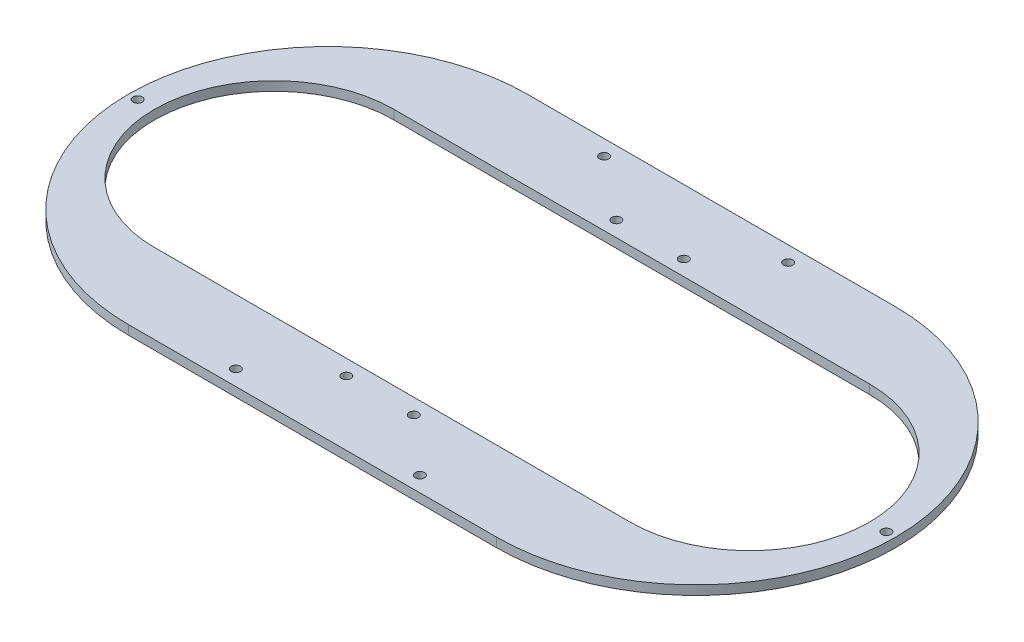
ISO-10303-21;
HEADER;
FILE_DESCRIPTION(('STEP AP214'),'2;1');
FILE_NAME('part.step','',(''),(''),'','','');
FILE_SCHEMA(('AUTOMOTIVE_DESIGN { 1 0 10303 214 1 1 1 1 }'));
ENDSEC;
DATA;
#1=APPLICATION_CONTEXT('core data for automotive mechanical design processes');
#2=APPLICATION_PROTOCOL_DEFINITION('international standard','automotive_design',2000,#1);
#3=PRODUCT_CONTEXT('',#1,'mechanical');
#4=PRODUCT('Part','Part','',(#3));
#5=PRODUCT_RELATED_PRODUCT_CATEGORY('part','',(#4));
#6=PRODUCT_DEFINITION_FORMATION('','',#4);
#7=PRODUCT_DEFINITION_CONTEXT('part definition',#1,'design');
#8=PRODUCT_DEFINITION('design','',#6,#7);
#9=PRODUCT_DEFINITION_SHAPE('','',#8);
#10=(LENGTH_UNIT() NAMED_UNIT(*) SI_UNIT(.MILLI.,.METRE.));
#11=(NAMED_UNIT(*) PLANE_ANGLE_UNIT() SI_UNIT($,.RADIAN.));
#12=(NAMED_UNIT(*) SI_UNIT($,.STERADIAN.) SOLID_ANGLE_UNIT());
#13=UNCERTAINTY_MEASURE_WITH_UNIT(LENGTH_MEASURE(1.E-05),#10,'distance_accuracy_value','');
#14=(GEOMETRIC_REPRESENTATION_CONTEXT(3) GLOBAL_UNCERTAINTY_ASSIGNED_CONTEXT((#13)) GLOBAL_UNIT_ASSIGNED_CONTEXT((#10,
#11,#12)) REPRESENTATION_CONTEXT('',''));
#15=CARTESIAN_POINT('',(0.,0.,0.));
#16=DIRECTION('',(0.,0.,1.));
#17=DIRECTION('',(1.,0.,0.));
#18=AXIS2_PLACEMENT_3D('',#15,#16,#17);
#19=CARTESIAN_POINT('',(0.,3.,-65.));
#20=DIRECTION('',(0.,0.,-1.));
#21=DIRECTION('',(-1.,0.,0.));
#22=AXIS2_PLACEMENT_3D('',#19,#20,#21);
#23=PLANE('',#22);
#24=DIRECTION('',(1.,0.,0.));
#25=VECTOR('',#24,1.);
#26=CARTESIAN_POINT('',(0.,0.,-65.));
#27=LINE('',#26,#25);
#28=CARTESIAN_POINT('',(-60.,0.,-65.));
#29=VERTEX_POINT('',#28);
#30=CARTESIAN_POINT('',(60.,0.,-65.));
#31=VERTEX_POINT('',#30);
#32=EDGE_CURVE('E224',#29,#31,#27,.T.);
#33=ORIENTED_EDGE('',*,*,#32,.F.);
#34=DIRECTION('',(0.,-1.,0.));
#35=VECTOR('',#34,1.);
#36=CARTESIAN_POINT('',(-60.,3.,-65.));
#37=LINE('',#36,#35);
#38=CARTESIAN_POINT('',(-60.,3.,-65.));
#39=VERTEX_POINT('',#38);
#40=EDGE_CURVE('E249',#39,#29,#37,.T.);
#41=ORIENTED_EDGE('',*,*,#40,.F.);
#42=DIRECTION('',(1.,0.,0.));
#43=VECTOR('',#42,1.);
#44=CARTESIAN_POINT('',(0.,3.,-65.));
#45=LINE('',#44,#43);
#46=CARTESIAN_POINT('',(60.,3.,-65.));
#47=VERTEX_POINT('',#46);
#48=EDGE_CURVE('E183',#39,#47,#45,.T.);
#49=ORIENTED_EDGE('',*,*,#48,.T.);
#50=DIRECTION('',(0.,-1.,0.));
#51=VECTOR('',#50,1.);
#52=CARTESIAN_POINT('',(60.,3.,-65.));
#53=LINE('',#52,#51);
#54=EDGE_CURVE('E198',#47,#31,#53,.T.);
#55=ORIENTED_EDGE('',*,*,#54,.T.);
#56=EDGE_LOOP('',(#33,#41,#49,#55));
#57=FACE_BOUND('',#56,.T.);
#58=ADVANCED_FACE('F40',(#57),#23,.T.);
#59=CARTESIAN_POINT('',(-60.,3.,0.));
#60=DIRECTION('',(0.,-1.,0.));
#61=DIRECTION('',(0.,0.,-1.));
#62=AXIS2_PLACEMENT_3D('',#59,#60,#61);
#63=CYLINDRICAL_SURFACE('',#62,65.);
#64=CARTESIAN_POINT('',(-60.,0.,0.));
#65=DIRECTION('',(0.,1.,0.));
#66=DIRECTION('',(0.,0.,1.));
#67=AXIS2_PLACEMENT_3D('',#64,#65,#66);
#68=CIRCLE('',#67,65.);
#69=CARTESIAN_POINT('',(-60.,0.,65.));
#70=VERTEX_POINT('',#69);
#71=EDGE_CURVE('E228',#29,#70,#68,.T.);
#72=ORIENTED_EDGE('',*,*,#71,.T.);
#73=DIRECTION('',(0.,-1.,0.));
#74=VECTOR('',#73,1.);
#75=CARTESIAN_POINT('',(-60.,3.,65.));
#76=LINE('',#75,#74);
#77=CARTESIAN_POINT('',(-60.,3.,65.));
#78=VERTEX_POINT('',#77);
#79=EDGE_CURVE('E245',#78,#70,#76,.T.);
#80=ORIENTED_EDGE('',*,*,#79,.F.);
#81=CARTESIAN_POINT('',(-60.,3.,0.));
#82=DIRECTION('',(0.,1.,0.));
#83=DIRECTION('',(0.,0.,1.));
#84=AXIS2_PLACEMENT_3D('',#81,#82,#83);
#85=CIRCLE('',#84,65.);
#86=EDGE_CURVE('E187',#39,#78,#85,.T.);
#87=ORIENTED_EDGE('',*,*,#86,.F.);
#88=ORIENTED_EDGE('',*,*,#40,.T.);
#89=EDGE_LOOP('',(#72,#80,#87,#88));
#90=FACE_BOUND('',#89,.T.);
#91=ADVANCED_FACE('F293',(#90),#63,.T.);
#92=CARTESIAN_POINT('',(0.,3.,65.));
#93=DIRECTION('',(0.,0.,-1.));
#94=DIRECTION('',(-1.,0.,0.));
#95=AXIS2_PLACEMENT_3D('',#92,#93,#94);
#96=PLANE('',#95);
#97=DIRECTION('',(1.,0.,0.));
#98=VECTOR('',#97,1.);
#99=CARTESIAN_POINT('',(0.,0.,65.));
#100=LINE('',#99,#98);
#101=CARTESIAN_POINT('',(60.,0.,65.));
#102=VERTEX_POINT('',#101);
#103=EDGE_CURVE('E232',#70,#102,#100,.T.);
#104=ORIENTED_EDGE('',*,*,#103,.T.);
#105=DIRECTION('',(0.,-1.,0.));
#106=VECTOR('',#105,1.);
#107=CARTESIAN_POINT('',(60.,3.,65.));
#108=LINE('',#107,#106);
#109=CARTESIAN_POINT('',(60.,3.,65.));
#110=VERTEX_POINT('',#109);
#111=EDGE_CURVE('E241',#110,#102,#108,.T.);
#112=ORIENTED_EDGE('',*,*,#111,.F.);
#113=DIRECTION('',(1.,0.,0.));
#114=VECTOR('',#113,1.);
#115=CARTESIAN_POINT('',(0.,3.,65.));
#116=LINE('',#115,#114);
#117=EDGE_CURVE('E191',#78,#110,#116,.T.);
#118=ORIENTED_EDGE('',*,*,#117,.F.);
#119=ORIENTED_EDGE('',*,*,#79,.T.);
#120=EDGE_LOOP('',(#104,#112,#118,#119));
#121=FACE_BOUND('',#120,.T.);
#122=ADVANCED_FACE('F299',(#121),#96,.F.);
#123=CARTESIAN_POINT('',(30.,3.,-60.));
#124=DIRECTION('',(0.,-1.,0.));
#125=DIRECTION('',(0.,0.,-1.));
#126=AXIS2_PLACEMENT_3D('',#123,#124,#125);
#127=CYLINDRICAL_SURFACE('',#126,1.5);
#128=CARTESIAN_POINT('',(30.,3.,-60.));
#129=DIRECTION('',(0.,1.,0.));
#130=DIRECTION('',(0.,0.,1.));
#131=AXIS2_PLACEMENT_3D('',#128,#129,#130);
#132=CIRCLE('',#131,1.5);
#133=CARTESIAN_POINT('',(30.,3.,-58.5));
#134=VERTEX_POINT('',#133);
#135=EDGE_CURVE('E179',#134,#134,#132,.F.);
#136=ORIENTED_EDGE('',*,*,#135,.F.);
#137=EDGE_LOOP('',(#136));
#138=FACE_BOUND('',#137,.T.);
#139=CARTESIAN_POINT('',(30.,0.,-60.));
#140=DIRECTION('',(0.,1.,0.));
#141=DIRECTION('',(0.,0.,1.));
#142=AXIS2_PLACEMENT_3D('',#139,#140,#141);
#143=CIRCLE('',#142,1.5);
#144=CARTESIAN_POINT('',(30.,0.,-58.5));
#145=VERTEX_POINT('',#144);
#146=EDGE_CURVE('E220',#145,#145,#143,.F.);
#147=ORIENTED_EDGE('',*,*,#146,.T.);
#148=EDGE_LOOP('',(#147));
#149=FACE_BOUND('',#148,.T.);
#150=ADVANCED_FACE('F305',(#138,#149),#127,.F.);
#151=CARTESIAN_POINT('',(-30.,3.,-60.));
#152=DIRECTION('',(0.,-1.,0.));
#153=DIRECTION('',(0.,0.,-1.));
#154=AXIS2_PLACEMENT_3D('',#151,#152,#153);
#155=CYLINDRICAL_SURFACE('',#154,1.5);
#156=CARTESIAN_POINT('',(-30.,3.,-60.));
#157=DIRECTION('',(0.,1.,0.));
#158=DIRECTION('',(0.,0.,1.));
#159=AXIS2_PLACEMENT_3D('',#156,#157,#158);
#160=CIRCLE('',#159,1.5);
#161=CARTESIAN_POINT('',(-30.,3.,-58.5));
#162=VERTEX_POINT('',#161);
#163=EDGE_CURVE('E175',#162,#162,#160,.T.);
#164=ORIENTED_EDGE('',*,*,#163,.T.);
#165=EDGE_LOOP('',(#164));
#166=FACE_BOUND('',#165,.T.);
#167=CARTESIAN_POINT('',(-30.,0.,-60.));
#168=DIRECTION('',(0.,1.,0.));
#169=DIRECTION('',(0.,0.,1.));
#170=AXIS2_PLACEMENT_3D('',#167,#168,#169);
#171=CIRCLE('',#170,1.5);
#172=CARTESIAN_POINT('',(-30.,0.,-58.5));
#173=VERTEX_POINT('',#172);
#174=EDGE_CURVE('E216',#173,#173,#171,.T.);
#175=ORIENTED_EDGE('',*,*,#174,.F.);
#176=EDGE_LOOP('',(#175));
#177=FACE_BOUND('',#176,.T.);
#178=ADVANCED_FACE('F308',(#166,#177),#155,.F.);
#179=CARTESIAN_POINT('',(122.,3.,0.));
#180=DIRECTION('',(0.,-1.,0.));
#181=DIRECTION('',(0.,0.,-1.));
#182=AXIS2_PLACEMENT_3D('',#179,#180,#181);
#183=CYLINDRICAL_SURFACE('',#182,1.5);
#184=CARTESIAN_POINT('',(122.,3.,0.));
#185=DIRECTION('',(0.,1.,0.));
#186=DIRECTION('',(0.,0.,1.));
#187=AXIS2_PLACEMENT_3D('',#184,#185,#186);
#188=CIRCLE('',#187,1.5);
#189=CARTESIAN_POINT('',(122.,3.,1.5));
#190=VERTEX_POINT('',#189);
#191=EDGE_CURVE('E171',#190,#190,#188,.T.);
#192=ORIENTED_EDGE('',*,*,#191,.T.);
#193=EDGE_LOOP('',(#192));
#194=FACE_BOUND('',#193,.T.);
#195=CARTESIAN_POINT('',(122.,0.,0.));
#196=DIRECTION('',(0.,1.,0.));
#197=DIRECTION('',(0.,0.,1.));
#198=AXIS2_PLACEMENT_3D('',#195,#196,#197);
#199=CIRCLE('',#198,1.5);
#200=CARTESIAN_POINT('',(122.,0.,1.5));
#201=VERTEX_POINT('',#200);
#202=EDGE_CURVE('E212',#201,#201,#199,.T.);
#203=ORIENTED_EDGE('',*,*,#202,.F.);
#204=EDGE_LOOP('',(#203));
#205=FACE_BOUND('',#204,.T.);
#206=ADVANCED_FACE('F312',(#194,#205),#183,.F.);
#207=CARTESIAN_POINT('',(-122.,3.,0.));
#208=DIRECTION('',(0.,-1.,0.));
#209=DIRECTION('',(0.,0.,-1.));
#210=AXIS2_PLACEMENT_3D('',#207,#208,#209);
#211=CYLINDRICAL_SURFACE('',#210,1.5);
#212=CARTESIAN_POINT('',(-122.,3.,0.));
#213=DIRECTION('',(0.,1.,0.));
#214=DIRECTION('',(0.,0.,1.));
#215=AXIS2_PLACEMENT_3D('',#212,#213,#214);
#216=CIRCLE('',#215,1.5);
#217=CARTESIAN_POINT('',(-122.,3.,1.5));
#218=VERTEX_POINT('',#217);
#219=EDGE_CURVE('E167',#218,#218,#216,.T.);
#220=ORIENTED_EDGE('',*,*,#219,.T.);
#221=EDGE_LOOP('',(#220));
#222=FACE_BOUND('',#221,.T.);
#223=CARTESIAN_POINT('',(-122.,0.,0.));
#224=DIRECTION('',(0.,1.,0.));
#225=DIRECTION('',(0.,0.,1.));
#226=AXIS2_PLACEMENT_3D('',#223,#224,#225);
#227=CIRCLE('',#226,1.5);
#228=CARTESIAN_POINT('',(-122.,0.,1.5));
#229=VERTEX_POINT('',#228);
#230=EDGE_CURVE('E208',#229,#229,#227,.T.);
#231=ORIENTED_EDGE('',*,*,#230,.F.);
#232=EDGE_LOOP('',(#231));
#233=FACE_BOUND('',#232,.T.);
#234=ADVANCED_FACE('F316',(#222,#233),#211,.F.);
#235=CARTESIAN_POINT('',(30.,3.,60.));
#236=DIRECTION('',(0.,-1.,0.));
#237=DIRECTION('',(0.,0.,-1.));
#238=AXIS2_PLACEMENT_3D('',#235,#236,#237);
#239=CYLINDRICAL_SURFACE('',#238,1.5);
#240=CARTESIAN_POINT('',(30.,3.,60.));
#241=DIRECTION('',(0.,1.,0.));
#242=DIRECTION('',(0.,0.,1.));
#243=AXIS2_PLACEMENT_3D('',#240,#241,#242);
#244=CIRCLE('',#243,1.5);
#245=CARTESIAN_POINT('',(30.,3.,61.5));
#246=VERTEX_POINT('',#245);
#247=EDGE_CURVE('E162',#246,#246,#244,.T.);
#248=ORIENTED_EDGE('',*,*,#247,.T.);
#249=EDGE_LOOP('',(#248));
#250=FACE_BOUND('',#249,.T.);
#251=CARTESIAN_POINT('',(30.,0.,60.));
#252=DIRECTION('',(0.,1.,0.));
#253=DIRECTION('',(0.,0.,1.));
#254=AXIS2_PLACEMENT_3D('',#251,#252,#253);
#255=CIRCLE('',#254,1.5);
#256=CARTESIAN_POINT('',(30.,0.,61.5));
#257=VERTEX_POINT('',#256);
#258=EDGE_CURVE('E203',#257,#257,#255,.T.);
#259=ORIENTED_EDGE('',*,*,#258,.F.);
#260=EDGE_LOOP('',(#259));
#261=FACE_BOUND('',#260,.T.);
#262=ADVANCED_FACE('F319',(#250,#261),#239,.F.);
#263=CARTESIAN_POINT('',(-30.,3.,60.));
#264=DIRECTION('',(0.,-1.,0.));
#265=DIRECTION('',(0.,0.,-1.));
#266=AXIS2_PLACEMENT_3D('',#263,#264,#265);
#267=CYLINDRICAL_SURFACE('',#266,1.5);
#268=CARTESIAN_POINT('',(-30.,3.,60.));
#269=DIRECTION('',(0.,1.,0.));
#270=DIRECTION('',(0.,0.,1.));
#271=AXIS2_PLACEMENT_3D('',#268,#269,#270);
#272=CIRCLE('',#271,1.5);
#273=CARTESIAN_POINT('',(-30.,3.,61.5));
#274=VERTEX_POINT('',#273);
#275=EDGE_CURVE('E158',#274,#274,#272,.F.);
#276=ORIENTED_EDGE('',*,*,#275,.F.);
#277=EDGE_LOOP('',(#276));
#278=FACE_BOUND('',#277,.T.);
#279=CARTESIAN_POINT('',(-30.,0.,60.));
#280=DIRECTION('',(0.,1.,0.));
#281=DIRECTION('',(0.,0.,1.));
#282=AXIS2_PLACEMENT_3D('',#279,#280,#281);
#283=CIRCLE('',#282,1.5);
#284=CARTESIAN_POINT('',(-30.,0.,61.5));
#285=VERTEX_POINT('',#284);
#286=EDGE_CURVE('E199',#285,#285,#283,.F.);
#287=ORIENTED_EDGE('',*,*,#286,.T.);
#288=EDGE_LOOP('',(#287));
#289=FACE_BOUND('',#288,.T.);
#290=ADVANCED_FACE('F42',(#278,#289),#267,.F.);
#291=CARTESIAN_POINT('',(60.,3.,0.));
#292=DIRECTION('',(0.,-1.,0.));
#293=DIRECTION('',(0.,0.,-1.));
#294=AXIS2_PLACEMENT_3D('',#291,#292,#293);
#295=CYLINDRICAL_SURFACE('',#294,65.);
#296=CARTESIAN_POINT('',(60.,0.,0.));
#297=DIRECTION('',(0.,1.,0.));
#298=DIRECTION('',(0.,0.,1.));
#299=AXIS2_PLACEMENT_3D('',#296,#297,#298);
#300=CIRCLE('',#299,65.);
#301=EDGE_CURVE('E163',#102,#31,#300,.T.);
#302=ORIENTED_EDGE('',*,*,#301,.T.);
#303=ORIENTED_EDGE('',*,*,#54,.F.);
#304=CARTESIAN_POINT('',(60.,3.,0.));
#305=DIRECTION('',(0.,1.,0.));
#306=DIRECTION('',(0.,0.,1.));
#307=AXIS2_PLACEMENT_3D('',#304,#305,#306);
#308=CIRCLE('',#307,65.);
#309=EDGE_CURVE('E195',#110,#47,#308,.T.);
#310=ORIENTED_EDGE('',*,*,#309,.F.);
#311=ORIENTED_EDGE('',*,*,#111,.T.);
#312=EDGE_LOOP('',(#302,#303,#310,#311));
#313=FACE_BOUND('',#312,.T.);
#314=ADVANCED_FACE('F326',(#313),#295,.T.);
#315=CARTESIAN_POINT('',(0.,3.,0.));
#316=DIRECTION('',(0.,1.,0.));
#317=DIRECTION('',(0.,0.,1.));
#318=AXIS2_PLACEMENT_3D('',#315,#316,#317);
#319=PLANE('',#318);
#320=CARTESIAN_POINT('',(-77.5,3.,0.));
#321=DIRECTION('',(0.,1.,0.));
#322=DIRECTION('',(0.,0.,1.));
#323=AXIS2_PLACEMENT_3D('',#320,#321,#322);
#324=CIRCLE('',#323,39.);
#325=CARTESIAN_POINT('',(-77.5,3.,-39.));
#326=VERTEX_POINT('',#325);
#327=CARTESIAN_POINT('',(-77.5,3.,39.));
#328=VERTEX_POINT('',#327);
#329=EDGE_CURVE('E56',#326,#328,#324,.T.);
#330=ORIENTED_EDGE('',*,*,#329,.F.);
#331=DIRECTION('',(-1.,0.,0.));
#332=VECTOR('',#331,1.);
#333=CARTESIAN_POINT('',(-77.5,3.,-39.));
#334=LINE('',#333,#332);
#335=CARTESIAN_POINT('',(77.5,3.,-39.));
#336=VERTEX_POINT('',#335);
#337=EDGE_CURVE('E127',#336,#326,#334,.T.);
#338=ORIENTED_EDGE('',*,*,#337,.F.);
#339=CARTESIAN_POINT('',(77.5,3.,0.));
#340=DIRECTION('',(0.,1.,0.));
#341=DIRECTION('',(0.,0.,1.));
#342=AXIS2_PLACEMENT_3D('',#339,#340,#341);
#343=CIRCLE('',#342,39.);
#344=CARTESIAN_POINT('',(77.5,3.,39.));
#345=VERTEX_POINT('',#344);
#346=EDGE_CURVE('E109',#345,#336,#343,.T.);
#347=ORIENTED_EDGE('',*,*,#346,.F.);
#348=DIRECTION('',(1.,0.,0.));
#349=VECTOR('',#348,1.);
#350=CARTESIAN_POINT('',(-77.5,3.,39.));
#351=LINE('',#350,#349);
#352=EDGE_CURVE('E119',#328,#345,#351,.T.);
#353=ORIENTED_EDGE('',*,*,#352,.F.);
#354=EDGE_LOOP('',(#330,#338,#347,#353));
#355=FACE_BOUND('',#354,.T.);
#356=CARTESIAN_POINT('',(12.,3.,-44.));
#357=DIRECTION('',(0.,1.,0.));
#358=DIRECTION('',(0.,0.,1.));
#359=AXIS2_PLACEMENT_3D('',#356,#357,#358);
#360=CIRCLE('',#359,1.5);
#361=CARTESIAN_POINT('',(12.,3.,-42.5));
#362=VERTEX_POINT('',#361);
#363=EDGE_CURVE('E146',#362,#362,#360,.T.);
#364=ORIENTED_EDGE('',*,*,#363,.F.);
#365=EDGE_LOOP('',(#364));
#366=FACE_BOUND('',#365,.T.);
#367=CARTESIAN_POINT('',(-10.,3.,44.));
#368=DIRECTION('',(0.,1.,0.));
#369=DIRECTION('',(0.,0.,1.));
#370=AXIS2_PLACEMENT_3D('',#367,#368,#369);
#371=CIRCLE('',#370,1.5);
#372=CARTESIAN_POINT('',(-10.,3.,45.5));
#373=VERTEX_POINT('',#372);
#374=EDGE_CURVE('E145',#373,#373,#371,.T.);
#375=ORIENTED_EDGE('',*,*,#374,.F.);
#376=EDGE_LOOP('',(#375));
#377=FACE_BOUND('',#376,.T.);
#378=CARTESIAN_POINT('',(12.,3.,44.));
#379=DIRECTION('',(0.,1.,0.));
#380=DIRECTION('',(0.,0.,1.));
#381=AXIS2_PLACEMENT_3D('',#378,#379,#380);
#382=CIRCLE('',#381,1.5);
#383=CARTESIAN_POINT('',(12.,3.,45.5));
#384=VERTEX_POINT('',#383);
#385=EDGE_CURVE('E137',#384,#384,#382,.T.);
#386=ORIENTED_EDGE('',*,*,#385,.F.);
#387=EDGE_LOOP('',(#386));
#388=FACE_BOUND('',#387,.T.);
#389=CARTESIAN_POINT('',(-10.,3.,-44.));
#390=DIRECTION('',(0.,1.,0.));
#391=DIRECTION('',(0.,0.,1.));
#392=AXIS2_PLACEMENT_3D('',#389,#390,#391);
#393=CIRCLE('',#392,1.5);
#394=CARTESIAN_POINT('',(-10.,3.,-42.5));
#395=VERTEX_POINT('',#394);
#396=EDGE_CURVE('E150',#395,#395,#393,.T.);
#397=ORIENTED_EDGE('',*,*,#396,.F.);
#398=EDGE_LOOP('',(#397));
#399=FACE_BOUND('',#398,.T.);
#400=ORIENTED_EDGE('',*,*,#275,.T.);
#401=EDGE_LOOP('',(#400));
#402=FACE_BOUND('',#401,.T.);
#403=ORIENTED_EDGE('',*,*,#247,.F.);
#404=EDGE_LOOP('',(#403));
#405=FACE_BOUND('',#404,.T.);
#406=ORIENTED_EDGE('',*,*,#219,.F.);
#407=EDGE_LOOP('',(#406));
#408=FACE_BOUND('',#407,.T.);
#409=ORIENTED_EDGE('',*,*,#191,.F.);
#410=EDGE_LOOP('',(#409));
#411=FACE_BOUND('',#410,.T.);
#412=ORIENTED_EDGE('',*,*,#163,.F.);
#413=EDGE_LOOP('',(#412));
#414=FACE_BOUND('',#413,.T.);
#415=ORIENTED_EDGE('',*,*,#135,.T.);
#416=EDGE_LOOP('',(#415));
#417=FACE_BOUND('',#416,.T.);
#418=ORIENTED_EDGE('',*,*,#48,.F.);
#419=ORIENTED_EDGE('',*,*,#86,.T.);
#420=ORIENTED_EDGE('',*,*,#117,.T.);
#421=ORIENTED_EDGE('',*,*,#309,.T.);
#422=EDGE_LOOP('',(#418,#419,#420,#421));
#423=FACE_BOUND('',#422,.T.);
#424=ADVANCED_FACE('F124',(#355,#366,#377,#388,#399,#402,#405,#408,#411,#414,#417,#423),#319,.T.);
#425=CARTESIAN_POINT('',(0.,0.,0.));
#426=DIRECTION('',(0.,1.,0.));
#427=DIRECTION('',(0.,0.,1.));
#428=AXIS2_PLACEMENT_3D('',#425,#426,#427);
#429=PLANE('',#428);
#430=DIRECTION('',(-1.,0.,0.));
#431=VECTOR('',#430,1.);
#432=CARTESIAN_POINT('',(0.,0.,-39.));
#433=LINE('',#432,#431);
#434=CARTESIAN_POINT('',(77.5,0.,-39.));
#435=VERTEX_POINT('',#434);
#436=CARTESIAN_POINT('',(-77.5,0.,-39.));
#437=VERTEX_POINT('',#436);
#438=EDGE_CURVE('E49',#435,#437,#433,.T.);
#439=ORIENTED_EDGE('',*,*,#438,.T.);
#440=CARTESIAN_POINT('',(-77.5,0.,0.));
#441=DIRECTION('',(0.,1.,0.));
#442=DIRECTION('',(0.,0.,1.));
#443=AXIS2_PLACEMENT_3D('',#440,#441,#442);
#444=CIRCLE('',#443,39.);
#445=CARTESIAN_POINT('',(-77.5,0.,39.));
#446=VERTEX_POINT('',#445);
#447=EDGE_CURVE('E11',#437,#446,#444,.T.);
#448=ORIENTED_EDGE('',*,*,#447,.T.);
#449=DIRECTION('',(1.,0.,0.));
#450=VECTOR('',#449,1.);
#451=CARTESIAN_POINT('',(0.,0.,39.));
#452=LINE('',#451,#450);
#453=CARTESIAN_POINT('',(77.5,0.,39.));
#454=VERTEX_POINT('',#453);
#455=EDGE_CURVE('E252',#446,#454,#452,.T.);
#456=ORIENTED_EDGE('',*,*,#455,.T.);
#457=CARTESIAN_POINT('',(77.5,0.,0.));
#458=DIRECTION('',(0.,1.,0.));
#459=DIRECTION('',(0.,0.,1.));
#460=AXIS2_PLACEMENT_3D('',#457,#458,#459);
#461=CIRCLE('',#460,39.);
#462=EDGE_CURVE('E112',#454,#435,#461,.T.);
#463=ORIENTED_EDGE('',*,*,#462,.T.);
#464=EDGE_LOOP('',(#439,#448,#456,#463));
#465=FACE_BOUND('',#464,.T.);
#466=CARTESIAN_POINT('',(12.,0.,-44.));
#467=DIRECTION('',(0.,1.,0.));
#468=DIRECTION('',(0.,0.,1.));
#469=AXIS2_PLACEMENT_3D('',#466,#467,#468);
#470=CIRCLE('',#469,1.5);
#471=CARTESIAN_POINT('',(12.,0.,-42.5));
#472=VERTEX_POINT('',#471);
#473=EDGE_CURVE('E204',#472,#472,#470,.T.);
#474=ORIENTED_EDGE('',*,*,#473,.T.);
#475=EDGE_LOOP('',(#474));
#476=FACE_BOUND('',#475,.T.);
#477=CARTESIAN_POINT('',(-10.,0.,44.));
#478=DIRECTION('',(0.,1.,0.));
#479=DIRECTION('',(0.,0.,1.));
#480=AXIS2_PLACEMENT_3D('',#477,#478,#479);
#481=CIRCLE('',#480,1.5);
#482=CARTESIAN_POINT('',(-10.,0.,45.5));
#483=VERTEX_POINT('',#482);
#484=EDGE_CURVE('E260',#483,#483,#481,.T.);
#485=ORIENTED_EDGE('',*,*,#484,.T.);
#486=EDGE_LOOP('',(#485));
#487=FACE_BOUND('',#486,.T.);
#488=CARTESIAN_POINT('',(12.,0.,44.));
#489=DIRECTION('',(0.,1.,0.));
#490=DIRECTION('',(0.,0.,1.));
#491=AXIS2_PLACEMENT_3D('',#488,#489,#490);
#492=CIRCLE('',#491,1.5);
#493=CARTESIAN_POINT('',(12.,0.,45.5));
#494=VERTEX_POINT('',#493);
#495=EDGE_CURVE('E256',#494,#494,#492,.T.);
#496=ORIENTED_EDGE('',*,*,#495,.T.);
#497=EDGE_LOOP('',(#496));
#498=FACE_BOUND('',#497,.T.);
#499=CARTESIAN_POINT('',(-10.,0.,-44.));
#500=DIRECTION('',(0.,1.,0.));
#501=DIRECTION('',(0.,0.,1.));
#502=AXIS2_PLACEMENT_3D('',#499,#500,#501);
#503=CIRCLE('',#502,1.5);
#504=CARTESIAN_POINT('',(-10.,0.,-42.5));
#505=VERTEX_POINT('',#504);
#506=EDGE_CURVE('E157',#505,#505,#503,.T.);
#507=ORIENTED_EDGE('',*,*,#506,.T.);
#508=EDGE_LOOP('',(#507));
#509=FACE_BOUND('',#508,.T.);
#510=ORIENTED_EDGE('',*,*,#286,.F.);
#511=EDGE_LOOP('',(#510));
#512=FACE_BOUND('',#511,.T.);
#513=ORIENTED_EDGE('',*,*,#258,.T.);
#514=EDGE_LOOP('',(#513));
#515=FACE_BOUND('',#514,.T.);
#516=ORIENTED_EDGE('',*,*,#230,.T.);
#517=EDGE_LOOP('',(#516));
#518=FACE_BOUND('',#517,.T.);
#519=ORIENTED_EDGE('',*,*,#202,.T.);
#520=EDGE_LOOP('',(#519));
#521=FACE_BOUND('',#520,.T.);
#522=ORIENTED_EDGE('',*,*,#174,.T.);
#523=EDGE_LOOP('',(#522));
#524=FACE_BOUND('',#523,.T.);
#525=ORIENTED_EDGE('',*,*,#146,.F.);
#526=EDGE_LOOP('',(#525));
#527=FACE_BOUND('',#526,.T.);
#528=ORIENTED_EDGE('',*,*,#32,.T.);
#529=ORIENTED_EDGE('',*,*,#301,.F.);
#530=ORIENTED_EDGE('',*,*,#103,.F.);
#531=ORIENTED_EDGE('',*,*,#71,.F.);
#532=EDGE_LOOP('',(#528,#529,#530,#531));
#533=FACE_BOUND('',#532,.T.);
#534=ADVANCED_FACE('F273',(#465,#476,#487,#498,#509,#512,#515,#518,#521,#524,#527,#533),#429,.F.);
#535=CARTESIAN_POINT('',(-10.,-7.,-44.));
#536=DIRECTION('',(0.,1.,0.));
#537=DIRECTION('',(0.,0.,1.));
#538=AXIS2_PLACEMENT_3D('',#535,#536,#537);
#539=CYLINDRICAL_SURFACE('',#538,1.5);
#540=ORIENTED_EDGE('',*,*,#396,.T.);
#541=EDGE_LOOP('',(#540));
#542=FACE_BOUND('',#541,.T.);
#543=ORIENTED_EDGE('',*,*,#506,.F.);
#544=EDGE_LOOP('',(#543));
#545=FACE_BOUND('',#544,.T.);
#546=ADVANCED_FACE('F334',(#542,#545),#539,.F.);
#547=CARTESIAN_POINT('',(12.,-7.,44.));
#548=DIRECTION('',(0.,1.,0.));
#549=DIRECTION('',(0.,0.,1.));
#550=AXIS2_PLACEMENT_3D('',#547,#548,#549);
#551=CYLINDRICAL_SURFACE('',#550,1.5);
#552=ORIENTED_EDGE('',*,*,#385,.T.);
#553=EDGE_LOOP('',(#552));
#554=FACE_BOUND('',#553,.T.);
#555=ORIENTED_EDGE('',*,*,#495,.F.);
#556=EDGE_LOOP('',(#555));
#557=FACE_BOUND('',#556,.T.);
#558=ADVANCED_FACE('F409',(#554,#557),#551,.F.);
#559=CARTESIAN_POINT('',(-10.,-7.,44.));
#560=DIRECTION('',(0.,1.,0.));
#561=DIRECTION('',(0.,0.,1.));
#562=AXIS2_PLACEMENT_3D('',#559,#560,#561);
#563=CYLINDRICAL_SURFACE('',#562,1.5);
#564=ORIENTED_EDGE('',*,*,#374,.T.);
#565=EDGE_LOOP('',(#564));
#566=FACE_BOUND('',#565,.T.);
#567=ORIENTED_EDGE('',*,*,#484,.F.);
#568=EDGE_LOOP('',(#567));
#569=FACE_BOUND('',#568,.T.);
#570=ADVANCED_FACE('F287',(#566,#569),#563,.F.);
#571=CARTESIAN_POINT('',(12.,-7.,-44.));
#572=DIRECTION('',(0.,1.,0.));
#573=DIRECTION('',(0.,0.,1.));
#574=AXIS2_PLACEMENT_3D('',#571,#572,#573);
#575=CYLINDRICAL_SURFACE('',#574,1.5);
#576=ORIENTED_EDGE('',*,*,#363,.T.);
#577=EDGE_LOOP('',(#576));
#578=FACE_BOUND('',#577,.T.);
#579=ORIENTED_EDGE('',*,*,#473,.F.);
#580=EDGE_LOOP('',(#579));
#581=FACE_BOUND('',#580,.T.);
#582=ADVANCED_FACE('F280',(#578,#581),#575,.F.);
#583=CARTESIAN_POINT('',(-77.5,-7.,0.));
#584=DIRECTION('',(0.,1.,0.));
#585=DIRECTION('',(0.,0.,1.));
#586=AXIS2_PLACEMENT_3D('',#583,#584,#585);
#587=CYLINDRICAL_SURFACE('',#586,39.);
#588=DIRECTION('',(0.,1.,0.));
#589=VECTOR('',#588,1.);
#590=CARTESIAN_POINT('',(-77.5,-7.,-39.));
#591=LINE('',#590,#589);
#592=EDGE_CURVE('E134',#437,#326,#591,.T.);
#593=ORIENTED_EDGE('',*,*,#592,.T.);
#594=ORIENTED_EDGE('',*,*,#329,.T.);
#595=DIRECTION('',(0.,1.,0.));
#596=VECTOR('',#595,1.);
#597=CARTESIAN_POINT('',(-77.5,-7.,39.));
#598=LINE('',#597,#596);
#599=EDGE_CURVE('E116',#446,#328,#598,.T.);
#600=ORIENTED_EDGE('',*,*,#599,.F.);
#601=ORIENTED_EDGE('',*,*,#447,.F.);
#602=EDGE_LOOP('',(#593,#594,#600,#601));
#603=FACE_BOUND('',#602,.T.);
#604=ADVANCED_FACE('F278',(#603),#587,.F.);
#605=CARTESIAN_POINT('',(-77.5,-7.,-39.));
#606=DIRECTION('',(0.,0.,-1.));
#607=DIRECTION('',(-1.,0.,0.));
#608=AXIS2_PLACEMENT_3D('',#605,#606,#607);
#609=PLANE('',#608);
#610=DIRECTION('',(0.,1.,0.));
#611=VECTOR('',#610,1.);
#612=CARTESIAN_POINT('',(77.5,-7.,-39.));
#613=LINE('',#612,#611);
#614=EDGE_CURVE('E115',#435,#336,#613,.T.);
#615=ORIENTED_EDGE('',*,*,#614,.T.);
#616=ORIENTED_EDGE('',*,*,#337,.T.);
#617=ORIENTED_EDGE('',*,*,#592,.F.);
#618=ORIENTED_EDGE('',*,*,#438,.F.);
#619=EDGE_LOOP('',(#615,#616,#617,#618));
#620=FACE_BOUND('',#619,.T.);
#621=ADVANCED_FACE('F277',(#620),#609,.F.);
#622=CARTESIAN_POINT('',(77.5,-7.,0.));
#623=DIRECTION('',(0.,1.,0.));
#624=DIRECTION('',(0.,0.,1.));
#625=AXIS2_PLACEMENT_3D('',#622,#623,#624);
#626=CYLINDRICAL_SURFACE('',#625,39.);
#627=DIRECTION('',(0.,1.,0.));
#628=VECTOR('',#627,1.);
#629=CARTESIAN_POINT('',(77.5,-7.,39.));
#630=LINE('',#629,#628);
#631=EDGE_CURVE('E64',#454,#345,#630,.T.);
#632=ORIENTED_EDGE('',*,*,#631,.T.);
#633=ORIENTED_EDGE('',*,*,#346,.T.);
#634=ORIENTED_EDGE('',*,*,#614,.F.);
#635=ORIENTED_EDGE('',*,*,#462,.F.);
#636=EDGE_LOOP('',(#632,#633,#634,#635));
#637=FACE_BOUND('',#636,.T.);
#638=ADVANCED_FACE('F106',(#637),#626,.F.);
#639=CARTESIAN_POINT('',(-77.5,-7.,39.));
#640=DIRECTION('',(0.,0.,1.));
#641=DIRECTION('',(1.,0.,0.));
#642=AXIS2_PLACEMENT_3D('',#639,#640,#641);
#643=PLANE('',#642);
#644=ORIENTED_EDGE('',*,*,#599,.T.);
#645=ORIENTED_EDGE('',*,*,#352,.T.);
#646=ORIENTED_EDGE('',*,*,#631,.F.);
#647=ORIENTED_EDGE('',*,*,#455,.F.);
#648=EDGE_LOOP('',(#644,#645,#646,#647));
#649=FACE_BOUND('',#648,.T.);
#650=ADVANCED_FACE('F120',(#649),#643,.F.);
#651=CLOSED_SHELL('',(#58,#91,#122,#150,#178,#206,#234,#262,#290,#314,#424,#534,#546,#558,#570,
#582,#604,#621,#638,#650));
#652=MANIFOLD_SOLID_BREP('B2',#651);
#653=ADVANCED_BREP_SHAPE_REPRESENTATION('',(#18,#652),#14);
#654=SHAPE_DEFINITION_REPRESENTATION(#9,#653);
ENDSEC;
END-ISO-10303-21;
